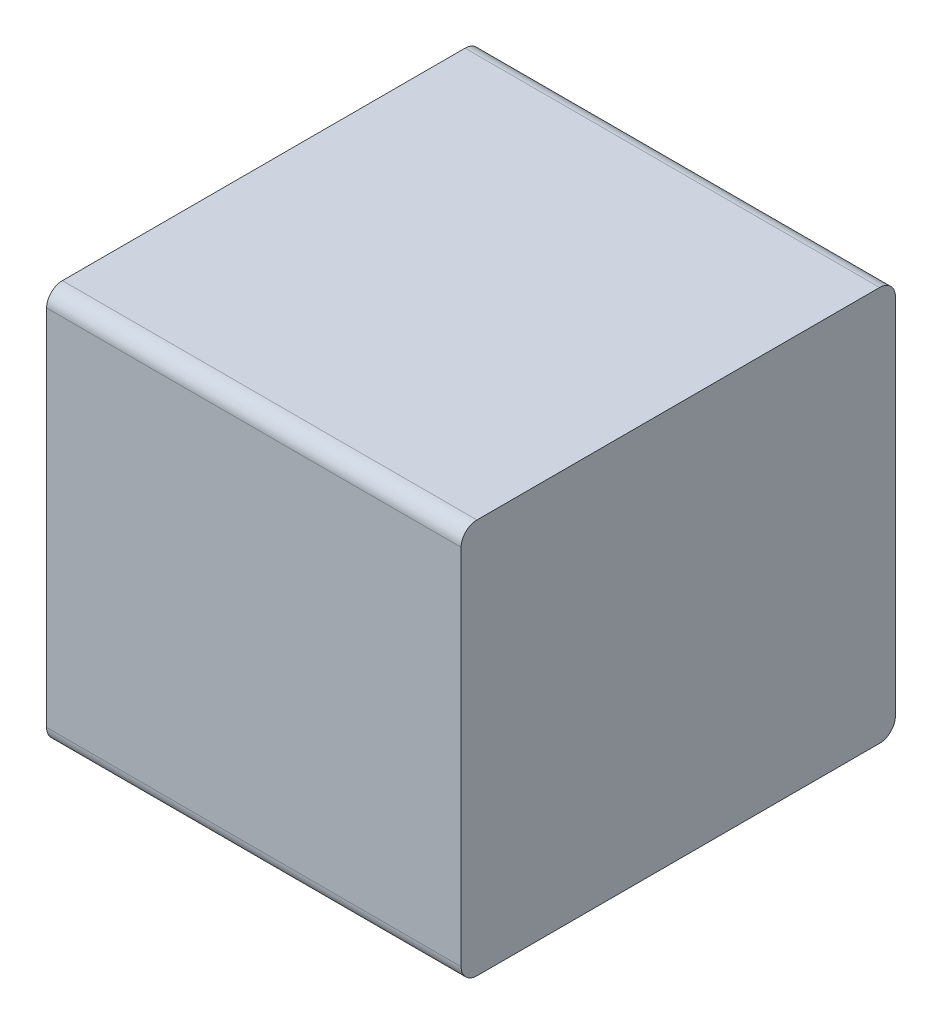
ISO-10303-21;
HEADER;
FILE_DESCRIPTION(('STEP AP214'),'2;1');
FILE_NAME('part.step','',(''),(''),'','','');
FILE_SCHEMA(('AUTOMOTIVE_DESIGN { 1 0 10303 214 1 1 1 1 }'));
ENDSEC;
DATA;
#1=APPLICATION_CONTEXT('core data for automotive mechanical design processes');
#2=APPLICATION_PROTOCOL_DEFINITION('international standard','automotive_design',2000,#1);
#3=PRODUCT_CONTEXT('',#1,'mechanical');
#4=PRODUCT('Part','Part','',(#3));
#5=PRODUCT_RELATED_PRODUCT_CATEGORY('part','',(#4));
#6=PRODUCT_DEFINITION_FORMATION('','',#4);
#7=PRODUCT_DEFINITION_CONTEXT('part definition',#1,'design');
#8=PRODUCT_DEFINITION('design','',#6,#7);
#9=PRODUCT_DEFINITION_SHAPE('','',#8);
#10=(LENGTH_UNIT() NAMED_UNIT(*) SI_UNIT(.MILLI.,.METRE.));
#11=(NAMED_UNIT(*) PLANE_ANGLE_UNIT() SI_UNIT($,.RADIAN.));
#12=(NAMED_UNIT(*) SI_UNIT($,.STERADIAN.) SOLID_ANGLE_UNIT());
#13=UNCERTAINTY_MEASURE_WITH_UNIT(LENGTH_MEASURE(1.E-05),#10,'distance_accuracy_value','');
#14=(GEOMETRIC_REPRESENTATION_CONTEXT(3) GLOBAL_UNCERTAINTY_ASSIGNED_CONTEXT((#13)) GLOBAL_UNIT_ASSIGNED_CONTEXT((#10,
#11,#12)) REPRESENTATION_CONTEXT('',''));
#15=CARTESIAN_POINT('',(0.,0.,0.));
#16=DIRECTION('',(0.,0.,1.));
#17=DIRECTION('',(1.,0.,0.));
#18=AXIS2_PLACEMENT_3D('',#15,#16,#17);
#19=CARTESIAN_POINT('',(0.13125,0.23,0.02));
#20=DIRECTION('',(1.,0.,0.));
#21=DIRECTION('',(0.,0.707106781186548,-0.707106781186547));
#22=AXIS2_PLACEMENT_3D('',#19,#20,#21);
#23=CYLINDRICAL_SURFACE('',#22,0.02);
#24=CARTESIAN_POINT('',(0.2625,0.23,0.02));
#25=DIRECTION('',(-1.,0.,0.));
#26=DIRECTION('',(0.,0.707106781186548,-0.707106781186547));
#27=AXIS2_PLACEMENT_3D('',#24,#25,#26);
#28=CIRCLE('',#27,0.02);
#29=CARTESIAN_POINT('',(0.2625,0.25,0.02));
#30=VERTEX_POINT('',#29);
#31=CARTESIAN_POINT('',(0.2625,0.23,0.));
#32=VERTEX_POINT('',#31);
#33=EDGE_CURVE('E11',#30,#32,#28,.T.);
#34=ORIENTED_EDGE('',*,*,#33,.T.);
#35=DIRECTION('',(-1.,0.,0.));
#36=VECTOR('',#35,1.);
#37=CARTESIAN_POINT('',(0.13125,0.23,0.));
#38=LINE('',#37,#36);
#39=CARTESIAN_POINT('',(-0.2625,0.23,0.));
#40=VERTEX_POINT('',#39);
#41=EDGE_CURVE('E24',#32,#40,#38,.T.);
#42=ORIENTED_EDGE('',*,*,#41,.T.);
#43=CARTESIAN_POINT('',(-0.2625,0.23,0.02));
#44=DIRECTION('',(1.,0.,0.));
#45=DIRECTION('',(0.,0.707106781186548,-0.707106781186547));
#46=AXIS2_PLACEMENT_3D('',#43,#44,#45);
#47=CIRCLE('',#46,0.02);
#48=CARTESIAN_POINT('',(-0.2625,0.25,0.02));
#49=VERTEX_POINT('',#48);
#50=EDGE_CURVE('E142',#40,#49,#47,.T.);
#51=ORIENTED_EDGE('',*,*,#50,.T.);
#52=DIRECTION('',(1.,0.,0.));
#53=VECTOR('',#52,1.);
#54=CARTESIAN_POINT('',(0.13125,0.25,0.02));
#55=LINE('',#54,#53);
#56=EDGE_CURVE('E140',#49,#30,#55,.T.);
#57=ORIENTED_EDGE('',*,*,#56,.T.);
#58=EDGE_LOOP('',(#34,#42,#51,#57));
#59=FACE_BOUND('',#58,.T.);
#60=ADVANCED_FACE('F17',(#59),#23,.T.);
#61=CARTESIAN_POINT('',(0.2625,0.25,0.));
#62=DIRECTION('',(0.,1.,0.));
#63=DIRECTION('',(-1.,0.,0.));
#64=AXIS2_PLACEMENT_3D('',#61,#62,#63);
#65=PLANE('',#64);
#66=ORIENTED_EDGE('',*,*,#56,.F.);
#67=DIRECTION('',(0.,0.,1.));
#68=VECTOR('',#67,1.);
#69=CARTESIAN_POINT('',(-0.2625,0.25,0.));
#70=LINE('',#69,#68);
#71=CARTESIAN_POINT('',(-0.2625,0.25,0.53));
#72=VERTEX_POINT('',#71);
#73=EDGE_CURVE('E138',#49,#72,#70,.T.);
#74=ORIENTED_EDGE('',*,*,#73,.T.);
#75=DIRECTION('',(-1.,0.,0.));
#76=VECTOR('',#75,1.);
#77=CARTESIAN_POINT('',(0.13125,0.25,0.53));
#78=LINE('',#77,#76);
#79=CARTESIAN_POINT('',(0.2625,0.25,0.53));
#80=VERTEX_POINT('',#79);
#81=EDGE_CURVE('E135',#80,#72,#78,.T.);
#82=ORIENTED_EDGE('',*,*,#81,.F.);
#83=DIRECTION('',(0.,0.,1.));
#84=VECTOR('',#83,1.);
#85=CARTESIAN_POINT('',(0.2625,0.25,0.));
#86=LINE('',#85,#84);
#87=EDGE_CURVE('E133',#30,#80,#86,.T.);
#88=ORIENTED_EDGE('',*,*,#87,.F.);
#89=EDGE_LOOP('',(#66,#74,#82,#88));
#90=FACE_BOUND('',#89,.T.);
#91=ADVANCED_FACE('F163',(#90),#65,.T.);
#92=CARTESIAN_POINT('',(-0.2625,0.25,0.));
#93=DIRECTION('',(-1.,0.,0.));
#94=DIRECTION('',(0.,-1.,0.));
#95=AXIS2_PLACEMENT_3D('',#92,#93,#94);
#96=PLANE('',#95);
#97=ORIENTED_EDGE('',*,*,#50,.F.);
#98=DIRECTION('',(0.,1.,0.));
#99=VECTOR('',#98,1.);
#100=CARTESIAN_POINT('',(-0.2625,-0.25,0.));
#101=LINE('',#100,#99);
#102=CARTESIAN_POINT('',(-0.2625,-0.23,0.));
#103=VERTEX_POINT('',#102);
#104=EDGE_CURVE('E130',#103,#40,#101,.T.);
#105=ORIENTED_EDGE('',*,*,#104,.F.);
#106=CARTESIAN_POINT('',(-0.2625,-0.23,0.02));
#107=DIRECTION('',(1.,0.,0.));
#108=DIRECTION('',(0.,-0.707106781186548,-0.707106781186547));
#109=AXIS2_PLACEMENT_3D('',#106,#107,#108);
#110=CIRCLE('',#109,0.02);
#111=CARTESIAN_POINT('',(-0.2625,-0.25,0.02));
#112=VERTEX_POINT('',#111);
#113=EDGE_CURVE('E127',#112,#103,#110,.T.);
#114=ORIENTED_EDGE('',*,*,#113,.F.);
#115=DIRECTION('',(0.,0.,1.));
#116=VECTOR('',#115,1.);
#117=CARTESIAN_POINT('',(-0.2625,-0.25,0.));
#118=LINE('',#117,#116);
#119=CARTESIAN_POINT('',(-0.2625,-0.25,0.53));
#120=VERTEX_POINT('',#119);
#121=EDGE_CURVE('E125',#112,#120,#118,.T.);
#122=ORIENTED_EDGE('',*,*,#121,.T.);
#123=CARTESIAN_POINT('',(-0.2625,-0.23,0.53));
#124=DIRECTION('',(1.,0.,0.));
#125=DIRECTION('',(0.,-0.707106781186548,0.707106781186548));
#126=AXIS2_PLACEMENT_3D('',#123,#124,#125);
#127=CIRCLE('',#126,0.02);
#128=CARTESIAN_POINT('',(-0.2625,-0.23,0.55));
#129=VERTEX_POINT('',#128);
#130=EDGE_CURVE('E123',#129,#120,#127,.T.);
#131=ORIENTED_EDGE('',*,*,#130,.F.);
#132=DIRECTION('',(0.,-1.,0.));
#133=VECTOR('',#132,1.);
#134=CARTESIAN_POINT('',(-0.2625,-0.25,0.55));
#135=LINE('',#134,#133);
#136=CARTESIAN_POINT('',(-0.2625,0.23,0.55));
#137=VERTEX_POINT('',#136);
#138=EDGE_CURVE('E101',#137,#129,#135,.T.);
#139=ORIENTED_EDGE('',*,*,#138,.F.);
#140=CARTESIAN_POINT('',(-0.2625,0.23,0.53));
#141=DIRECTION('',(1.,0.,0.));
#142=DIRECTION('',(0.,0.707106781186548,0.707106781186548));
#143=AXIS2_PLACEMENT_3D('',#140,#141,#142);
#144=CIRCLE('',#143,0.02);
#145=EDGE_CURVE('E119',#72,#137,#144,.T.);
#146=ORIENTED_EDGE('',*,*,#145,.F.);
#147=ORIENTED_EDGE('',*,*,#73,.F.);
#148=EDGE_LOOP('',(#97,#105,#114,#122,#131,#139,#146,#147));
#149=FACE_BOUND('',#148,.T.);
#150=ADVANCED_FACE('F148',(#149),#96,.T.);
#151=CARTESIAN_POINT('',(-0.13125,-0.23,0.02));
#152=DIRECTION('',(-1.,0.,0.));
#153=DIRECTION('',(0.,-0.707106781186548,-0.707106781186547));
#154=AXIS2_PLACEMENT_3D('',#151,#152,#153);
#155=CYLINDRICAL_SURFACE('',#154,0.02);
#156=ORIENTED_EDGE('',*,*,#113,.T.);
#157=DIRECTION('',(1.,0.,0.));
#158=VECTOR('',#157,1.);
#159=CARTESIAN_POINT('',(-0.13125,-0.23,0.));
#160=LINE('',#159,#158);
#161=CARTESIAN_POINT('',(0.2625,-0.23,0.));
#162=VERTEX_POINT('',#161);
#163=EDGE_CURVE('E117',#103,#162,#160,.T.);
#164=ORIENTED_EDGE('',*,*,#163,.T.);
#165=CARTESIAN_POINT('',(0.2625,-0.23,0.02));
#166=DIRECTION('',(-1.,0.,0.));
#167=DIRECTION('',(0.,-0.707106781186548,-0.707106781186547));
#168=AXIS2_PLACEMENT_3D('',#165,#166,#167);
#169=CIRCLE('',#168,0.02);
#170=CARTESIAN_POINT('',(0.2625,-0.25,0.02));
#171=VERTEX_POINT('',#170);
#172=EDGE_CURVE('E115',#162,#171,#169,.T.);
#173=ORIENTED_EDGE('',*,*,#172,.T.);
#174=DIRECTION('',(-1.,0.,0.));
#175=VECTOR('',#174,1.);
#176=CARTESIAN_POINT('',(-0.13125,-0.25,0.02));
#177=LINE('',#176,#175);
#178=EDGE_CURVE('E112',#171,#112,#177,.T.);
#179=ORIENTED_EDGE('',*,*,#178,.T.);
#180=EDGE_LOOP('',(#156,#164,#173,#179));
#181=FACE_BOUND('',#180,.T.);
#182=ADVANCED_FACE('F154',(#181),#155,.T.);
#183=CARTESIAN_POINT('',(-0.2625,-0.25,0.));
#184=DIRECTION('',(0.,-1.,0.));
#185=DIRECTION('',(1.,0.,0.));
#186=AXIS2_PLACEMENT_3D('',#183,#184,#185);
#187=PLANE('',#186);
#188=ORIENTED_EDGE('',*,*,#178,.F.);
#189=DIRECTION('',(0.,0.,1.));
#190=VECTOR('',#189,1.);
#191=CARTESIAN_POINT('',(0.2625,-0.25,0.));
#192=LINE('',#191,#190);
#193=CARTESIAN_POINT('',(0.2625,-0.25,0.53));
#194=VERTEX_POINT('',#193);
#195=EDGE_CURVE('E110',#171,#194,#192,.T.);
#196=ORIENTED_EDGE('',*,*,#195,.T.);
#197=DIRECTION('',(1.,0.,0.));
#198=VECTOR('',#197,1.);
#199=CARTESIAN_POINT('',(-0.13125,-0.25,0.53));
#200=LINE('',#199,#198);
#201=EDGE_CURVE('E96',#120,#194,#200,.T.);
#202=ORIENTED_EDGE('',*,*,#201,.F.);
#203=ORIENTED_EDGE('',*,*,#121,.F.);
#204=EDGE_LOOP('',(#188,#196,#202,#203));
#205=FACE_BOUND('',#204,.T.);
#206=ADVANCED_FACE('F157',(#205),#187,.T.);
#207=CARTESIAN_POINT('',(0.2625,-0.25,0.));
#208=DIRECTION('',(1.,0.,0.));
#209=DIRECTION('',(0.,1.,0.));
#210=AXIS2_PLACEMENT_3D('',#207,#208,#209);
#211=PLANE('',#210);
#212=ORIENTED_EDGE('',*,*,#33,.F.);
#213=ORIENTED_EDGE('',*,*,#87,.T.);
#214=CARTESIAN_POINT('',(0.2625,0.23,0.53));
#215=DIRECTION('',(-1.,0.,0.));
#216=DIRECTION('',(0.,0.707106781186548,0.707106781186548));
#217=AXIS2_PLACEMENT_3D('',#214,#215,#216);
#218=CIRCLE('',#217,0.02);
#219=CARTESIAN_POINT('',(0.2625,0.23,0.55));
#220=VERTEX_POINT('',#219);
#221=EDGE_CURVE('E83',#220,#80,#218,.T.);
#222=ORIENTED_EDGE('',*,*,#221,.F.);
#223=DIRECTION('',(0.,1.,0.));
#224=VECTOR('',#223,1.);
#225=CARTESIAN_POINT('',(0.2625,0.25,0.55));
#226=LINE('',#225,#224);
#227=CARTESIAN_POINT('',(0.2625,-0.23,0.55));
#228=VERTEX_POINT('',#227);
#229=EDGE_CURVE('E77',#228,#220,#226,.T.);
#230=ORIENTED_EDGE('',*,*,#229,.F.);
#231=CARTESIAN_POINT('',(0.2625,-0.23,0.53));
#232=DIRECTION('',(-1.,0.,0.));
#233=DIRECTION('',(0.,-0.707106781186548,0.707106781186548));
#234=AXIS2_PLACEMENT_3D('',#231,#232,#233);
#235=CIRCLE('',#234,0.02);
#236=EDGE_CURVE('E81',#194,#228,#235,.T.);
#237=ORIENTED_EDGE('',*,*,#236,.F.);
#238=ORIENTED_EDGE('',*,*,#195,.F.);
#239=ORIENTED_EDGE('',*,*,#172,.F.);
#240=DIRECTION('',(0.,-1.,0.));
#241=VECTOR('',#240,1.);
#242=CARTESIAN_POINT('',(0.2625,0.25,0.));
#243=LINE('',#242,#241);
#244=EDGE_CURVE('E97',#32,#162,#243,.T.);
#245=ORIENTED_EDGE('',*,*,#244,.F.);
#246=EDGE_LOOP('',(#212,#213,#222,#230,#237,#238,#239,#245));
#247=FACE_BOUND('',#246,.T.);
#248=ADVANCED_FACE('F79',(#247),#211,.T.);
#249=CARTESIAN_POINT('',(0.13125,0.23,0.53));
#250=DIRECTION('',(-1.,0.,0.));
#251=DIRECTION('',(0.,0.707106781186548,0.707106781186548));
#252=AXIS2_PLACEMENT_3D('',#249,#250,#251);
#253=CYLINDRICAL_SURFACE('',#252,0.02);
#254=ORIENTED_EDGE('',*,*,#145,.T.);
#255=DIRECTION('',(1.,0.,0.));
#256=VECTOR('',#255,1.);
#257=CARTESIAN_POINT('',(0.13125,0.23,0.55));
#258=LINE('',#257,#256);
#259=EDGE_CURVE('E102',#137,#220,#258,.T.);
#260=ORIENTED_EDGE('',*,*,#259,.T.);
#261=ORIENTED_EDGE('',*,*,#221,.T.);
#262=ORIENTED_EDGE('',*,*,#81,.T.);
#263=EDGE_LOOP('',(#254,#260,#261,#262));
#264=FACE_BOUND('',#263,.T.);
#265=ADVANCED_FACE('F160',(#264),#253,.T.);
#266=CARTESIAN_POINT('',(0.,0.,0.55));
#267=DIRECTION('',(0.,0.,1.));
#268=DIRECTION('',(1.,0.,0.));
#269=AXIS2_PLACEMENT_3D('',#266,#267,#268);
#270=PLANE('',#269);
#271=ORIENTED_EDGE('',*,*,#259,.F.);
#272=ORIENTED_EDGE('',*,*,#138,.T.);
#273=DIRECTION('',(-1.,0.,0.));
#274=VECTOR('',#273,1.);
#275=CARTESIAN_POINT('',(-0.13125,-0.23,0.55));
#276=LINE('',#275,#274);
#277=EDGE_CURVE('E94',#228,#129,#276,.T.);
#278=ORIENTED_EDGE('',*,*,#277,.F.);
#279=ORIENTED_EDGE('',*,*,#229,.T.);
#280=EDGE_LOOP('',(#271,#272,#278,#279));
#281=FACE_BOUND('',#280,.T.);
#282=ADVANCED_FACE('F100',(#281),#270,.T.);
#283=CARTESIAN_POINT('',(-0.13125,-0.23,0.53));
#284=DIRECTION('',(1.,0.,0.));
#285=DIRECTION('',(0.,-0.707106781186548,0.707106781186548));
#286=AXIS2_PLACEMENT_3D('',#283,#284,#285);
#287=CYLINDRICAL_SURFACE('',#286,0.02);
#288=ORIENTED_EDGE('',*,*,#236,.T.);
#289=ORIENTED_EDGE('',*,*,#277,.T.);
#290=ORIENTED_EDGE('',*,*,#130,.T.);
#291=ORIENTED_EDGE('',*,*,#201,.T.);
#292=EDGE_LOOP('',(#288,#289,#290,#291));
#293=FACE_BOUND('',#292,.T.);
#294=ADVANCED_FACE('F92',(#293),#287,.T.);
#295=CARTESIAN_POINT('',(0.,0.,0.));
#296=DIRECTION('',(0.,0.,1.));
#297=DIRECTION('',(1.,0.,0.));
#298=AXIS2_PLACEMENT_3D('',#295,#296,#297);
#299=PLANE('',#298);
#300=ORIENTED_EDGE('',*,*,#41,.F.);
#301=ORIENTED_EDGE('',*,*,#244,.T.);
#302=ORIENTED_EDGE('',*,*,#163,.F.);
#303=ORIENTED_EDGE('',*,*,#104,.T.);
#304=EDGE_LOOP('',(#300,#301,#302,#303));
#305=FACE_BOUND('',#304,.T.);
#306=ADVANCED_FACE('F151',(#305),#299,.F.);
#307=CLOSED_SHELL('',(#60,#91,#150,#182,#206,#248,#265,#282,#294,#306));
#308=MANIFOLD_SOLID_BREP('B1',#307);
#309=ADVANCED_BREP_SHAPE_REPRESENTATION('',(#18,#308),#14);
#310=SHAPE_DEFINITION_REPRESENTATION(#9,#309);
ENDSEC;
END-ISO-10303-21;
